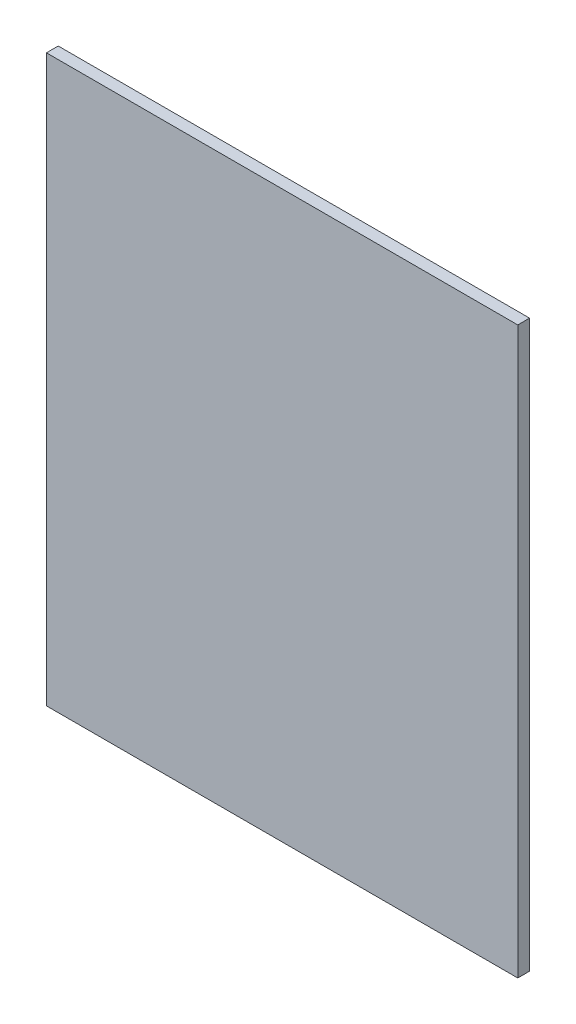
ISO-10303-21;
HEADER;
FILE_DESCRIPTION(('STEP AP214'),'2;1');
FILE_NAME('part.step','',(''),(''),'','','');
FILE_SCHEMA(('AUTOMOTIVE_DESIGN { 1 0 10303 214 1 1 1 1 }'));
ENDSEC;
DATA;
#1=APPLICATION_CONTEXT('core data for automotive mechanical design processes');
#2=APPLICATION_PROTOCOL_DEFINITION('international standard','automotive_design',2000,#1);
#3=PRODUCT_CONTEXT('',#1,'mechanical');
#4=PRODUCT('Part','Part','',(#3));
#5=PRODUCT_RELATED_PRODUCT_CATEGORY('part','',(#4));
#6=PRODUCT_DEFINITION_FORMATION('','',#4);
#7=PRODUCT_DEFINITION_CONTEXT('part definition',#1,'design');
#8=PRODUCT_DEFINITION('design','',#6,#7);
#9=PRODUCT_DEFINITION_SHAPE('','',#8);
#10=(LENGTH_UNIT() NAMED_UNIT(*) SI_UNIT(.MILLI.,.METRE.));
#11=(NAMED_UNIT(*) PLANE_ANGLE_UNIT() SI_UNIT($,.RADIAN.));
#12=(NAMED_UNIT(*) SI_UNIT($,.STERADIAN.) SOLID_ANGLE_UNIT());
#13=UNCERTAINTY_MEASURE_WITH_UNIT(LENGTH_MEASURE(1.E-05),#10,'distance_accuracy_value','');
#14=(GEOMETRIC_REPRESENTATION_CONTEXT(3) GLOBAL_UNCERTAINTY_ASSIGNED_CONTEXT((#13)) GLOBAL_UNIT_ASSIGNED_CONTEXT((#10,
#11,#12)) REPRESENTATION_CONTEXT('',''));
#15=CARTESIAN_POINT('',(0.,0.,0.));
#16=DIRECTION('',(0.,0.,1.));
#17=DIRECTION('',(1.,0.,0.));
#18=AXIS2_PLACEMENT_3D('',#15,#16,#17);
#19=CARTESIAN_POINT('',(-59.631783104976,34.4622568244404,10.));
#20=DIRECTION('',(1.,0.,0.));
#21=DIRECTION('',(0.,1.,0.));
#22=AXIS2_PLACEMENT_3D('',#19,#20,#21);
#23=PLANE('',#22);
#24=DIRECTION('',(0.,-1.,0.));
#25=VECTOR('',#24,1.);
#26=CARTESIAN_POINT('',(-59.631783104976,34.4622568244404,0.));
#27=LINE('',#26,#25);
#28=CARTESIAN_POINT('',(-59.631783104976,34.4622568244404,0.));
#29=VERTEX_POINT('',#28);
#30=CARTESIAN_POINT('',(-59.6317831049759,-445.53774317556,0.));
#31=VERTEX_POINT('',#30);
#32=EDGE_CURVE('E94',#29,#31,#27,.T.);
#33=ORIENTED_EDGE('',*,*,#32,.T.);
#34=DIRECTION('',(0.,0.,-1.));
#35=VECTOR('',#34,1.);
#36=CARTESIAN_POINT('',(-59.6317831049759,-445.53774317556,10.));
#37=LINE('',#36,#35);
#38=CARTESIAN_POINT('',(-59.6317831049759,-445.53774317556,10.));
#39=VERTEX_POINT('',#38);
#40=EDGE_CURVE('E11',#39,#31,#37,.T.);
#41=ORIENTED_EDGE('',*,*,#40,.F.);
#42=DIRECTION('',(0.,-1.,0.));
#43=VECTOR('',#42,1.);
#44=CARTESIAN_POINT('',(-59.631783104976,34.4622568244404,10.));
#45=LINE('',#44,#43);
#46=CARTESIAN_POINT('',(-59.631783104976,34.4622568244404,10.));
#47=VERTEX_POINT('',#46);
#48=EDGE_CURVE('E82',#47,#39,#45,.T.);
#49=ORIENTED_EDGE('',*,*,#48,.F.);
#50=DIRECTION('',(0.,0.,-1.));
#51=VECTOR('',#50,1.);
#52=CARTESIAN_POINT('',(-59.631783104976,34.4622568244404,10.));
#53=LINE('',#52,#51);
#54=EDGE_CURVE('E90',#47,#29,#53,.T.);
#55=ORIENTED_EDGE('',*,*,#54,.T.);
#56=EDGE_LOOP('',(#33,#41,#49,#55));
#57=FACE_BOUND('',#56,.T.);
#58=ADVANCED_FACE('F31',(#57),#23,.F.);
#59=CARTESIAN_POINT('',(-59.6317831049759,-445.53774317556,10.));
#60=DIRECTION('',(0.,1.,0.));
#61=DIRECTION('',(0.,0.,1.));
#62=AXIS2_PLACEMENT_3D('',#59,#60,#61);
#63=PLANE('',#62);
#64=DIRECTION('',(1.,0.,0.));
#65=VECTOR('',#64,1.);
#66=CARTESIAN_POINT('',(-59.6317831049759,-445.53774317556,0.));
#67=LINE('',#66,#65);
#68=CARTESIAN_POINT('',(340.368216895024,-445.53774317556,0.));
#69=VERTEX_POINT('',#68);
#70=EDGE_CURVE('E86',#31,#69,#67,.T.);
#71=ORIENTED_EDGE('',*,*,#70,.T.);
#72=DIRECTION('',(0.,0.,-1.));
#73=VECTOR('',#72,1.);
#74=CARTESIAN_POINT('',(340.368216895024,-445.53774317556,10.));
#75=LINE('',#74,#73);
#76=CARTESIAN_POINT('',(340.368216895024,-445.53774317556,10.));
#77=VERTEX_POINT('',#76);
#78=EDGE_CURVE('E39',#77,#69,#75,.T.);
#79=ORIENTED_EDGE('',*,*,#78,.F.);
#80=DIRECTION('',(1.,0.,0.));
#81=VECTOR('',#80,1.);
#82=CARTESIAN_POINT('',(-59.6317831049759,-445.53774317556,10.));
#83=LINE('',#82,#81);
#84=EDGE_CURVE('E77',#39,#77,#83,.T.);
#85=ORIENTED_EDGE('',*,*,#84,.F.);
#86=ORIENTED_EDGE('',*,*,#40,.T.);
#87=EDGE_LOOP('',(#71,#79,#85,#86));
#88=FACE_BOUND('',#87,.T.);
#89=ADVANCED_FACE('F85',(#88),#63,.F.);
#90=CARTESIAN_POINT('',(340.368216895024,34.4622568244404,10.));
#91=DIRECTION('',(-1.,0.,0.));
#92=DIRECTION('',(0.,-1.,0.));
#93=AXIS2_PLACEMENT_3D('',#90,#91,#92);
#94=PLANE('',#93);
#95=DIRECTION('',(0.,1.,0.));
#96=VECTOR('',#95,1.);
#97=CARTESIAN_POINT('',(340.368216895024,34.4622568244404,0.));
#98=LINE('',#97,#96);
#99=CARTESIAN_POINT('',(340.368216895024,34.4622568244404,0.));
#100=VERTEX_POINT('',#99);
#101=EDGE_CURVE('E64',#69,#100,#98,.T.);
#102=ORIENTED_EDGE('',*,*,#101,.T.);
#103=DIRECTION('',(0.,0.,-1.));
#104=VECTOR('',#103,1.);
#105=CARTESIAN_POINT('',(340.368216895024,34.4622568244404,10.));
#106=LINE('',#105,#104);
#107=CARTESIAN_POINT('',(340.368216895024,34.4622568244404,10.));
#108=VERTEX_POINT('',#107);
#109=EDGE_CURVE('E87',#108,#100,#106,.T.);
#110=ORIENTED_EDGE('',*,*,#109,.F.);
#111=DIRECTION('',(0.,1.,0.));
#112=VECTOR('',#111,1.);
#113=CARTESIAN_POINT('',(340.368216895024,34.4622568244404,10.));
#114=LINE('',#113,#112);
#115=EDGE_CURVE('E80',#77,#108,#114,.T.);
#116=ORIENTED_EDGE('',*,*,#115,.F.);
#117=ORIENTED_EDGE('',*,*,#78,.T.);
#118=EDGE_LOOP('',(#102,#110,#116,#117));
#119=FACE_BOUND('',#118,.T.);
#120=ADVANCED_FACE('F88',(#119),#94,.F.);
#121=CARTESIAN_POINT('',(-59.631783104976,34.4622568244404,10.));
#122=DIRECTION('',(0.,-1.,0.));
#123=DIRECTION('',(0.,0.,-1.));
#124=AXIS2_PLACEMENT_3D('',#121,#122,#123);
#125=PLANE('',#124);
#126=DIRECTION('',(-1.,0.,0.));
#127=VECTOR('',#126,1.);
#128=CARTESIAN_POINT('',(-59.631783104976,34.4622568244404,0.));
#129=LINE('',#128,#127);
#130=EDGE_CURVE('E70',#100,#29,#129,.T.);
#131=ORIENTED_EDGE('',*,*,#130,.T.);
#132=ORIENTED_EDGE('',*,*,#54,.F.);
#133=DIRECTION('',(-1.,0.,0.));
#134=VECTOR('',#133,1.);
#135=CARTESIAN_POINT('',(-59.631783104976,34.4622568244404,10.));
#136=LINE('',#135,#134);
#137=EDGE_CURVE('E47',#108,#47,#136,.T.);
#138=ORIENTED_EDGE('',*,*,#137,.F.);
#139=ORIENTED_EDGE('',*,*,#109,.T.);
#140=EDGE_LOOP('',(#131,#132,#138,#139));
#141=FACE_BOUND('',#140,.T.);
#142=ADVANCED_FACE('F101',(#141),#125,.F.);
#143=CARTESIAN_POINT('',(-59.6317831049759,-445.53774317556,10.));
#144=DIRECTION('',(0.,0.,1.));
#145=DIRECTION('',(1.,0.,0.));
#146=AXIS2_PLACEMENT_3D('',#143,#144,#145);
#147=PLANE('',#146);
#148=ORIENTED_EDGE('',*,*,#48,.T.);
#149=ORIENTED_EDGE('',*,*,#84,.T.);
#150=ORIENTED_EDGE('',*,*,#115,.T.);
#151=ORIENTED_EDGE('',*,*,#137,.T.);
#152=EDGE_LOOP('',(#148,#149,#150,#151));
#153=FACE_BOUND('',#152,.T.);
#154=ADVANCED_FACE('F78',(#153),#147,.T.);
#155=CARTESIAN_POINT('',(-59.6317831049759,-445.53774317556,0.));
#156=DIRECTION('',(0.,0.,1.));
#157=DIRECTION('',(1.,0.,0.));
#158=AXIS2_PLACEMENT_3D('',#155,#156,#157);
#159=PLANE('',#158);
#160=ORIENTED_EDGE('',*,*,#32,.F.);
#161=ORIENTED_EDGE('',*,*,#130,.F.);
#162=ORIENTED_EDGE('',*,*,#101,.F.);
#163=ORIENTED_EDGE('',*,*,#70,.F.);
#164=EDGE_LOOP('',(#160,#161,#162,#163));
#165=FACE_BOUND('',#164,.T.);
#166=ADVANCED_FACE('F104',(#165),#159,.F.);
#167=CLOSED_SHELL('',(#58,#89,#120,#142,#154,#166));
#168=MANIFOLD_SOLID_BREP('B2',#167);
#169=ADVANCED_BREP_SHAPE_REPRESENTATION('',(#18,#168),#14);
#170=SHAPE_DEFINITION_REPRESENTATION(#9,#169);
ENDSEC;
END-ISO-10303-21;
